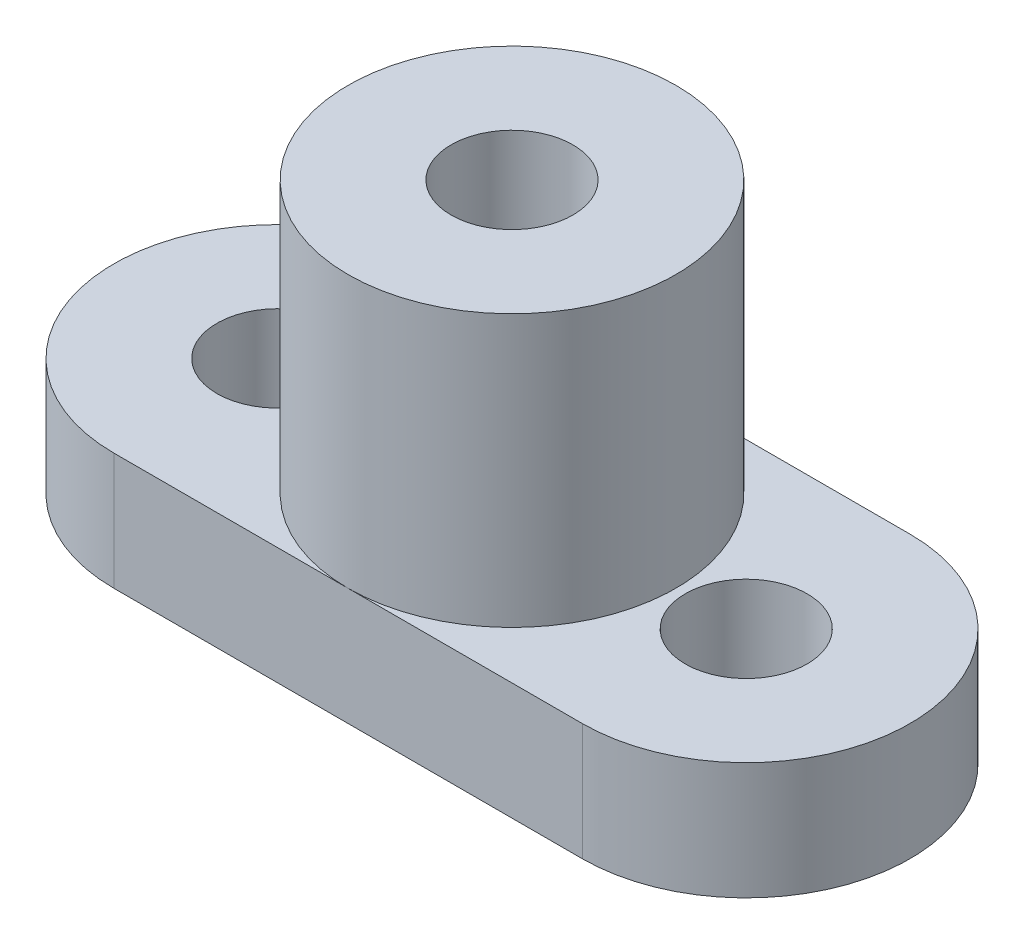
ISO-10303-21;
HEADER;
FILE_DESCRIPTION(('STEP AP214'),'2;1');
FILE_NAME('part.step','',(''),(''),'','','');
FILE_SCHEMA(('AUTOMOTIVE_DESIGN { 1 0 10303 214 1 1 1 1 }'));
ENDSEC;
DATA;
#1=APPLICATION_CONTEXT('core data for automotive mechanical design processes');
#2=APPLICATION_PROTOCOL_DEFINITION('international standard','automotive_design',2000,#1);
#3=PRODUCT_CONTEXT('',#1,'mechanical');
#4=PRODUCT('Part','Part','',(#3));
#5=PRODUCT_RELATED_PRODUCT_CATEGORY('part','',(#4));
#6=PRODUCT_DEFINITION_FORMATION('','',#4);
#7=PRODUCT_DEFINITION_CONTEXT('part definition',#1,'design');
#8=PRODUCT_DEFINITION('design','',#6,#7);
#9=PRODUCT_DEFINITION_SHAPE('','',#8);
#10=(LENGTH_UNIT() NAMED_UNIT(*) SI_UNIT(.MILLI.,.METRE.));
#11=(NAMED_UNIT(*) PLANE_ANGLE_UNIT() SI_UNIT($,.RADIAN.));
#12=(NAMED_UNIT(*) SI_UNIT($,.STERADIAN.) SOLID_ANGLE_UNIT());
#13=UNCERTAINTY_MEASURE_WITH_UNIT(LENGTH_MEASURE(1.E-05),#10,'distance_accuracy_value','');
#14=(GEOMETRIC_REPRESENTATION_CONTEXT(3) GLOBAL_UNCERTAINTY_ASSIGNED_CONTEXT((#13)) GLOBAL_UNIT_ASSIGNED_CONTEXT((#10,
#11,#12)) REPRESENTATION_CONTEXT('',''));
#15=CARTESIAN_POINT('',(0.,0.,0.));
#16=DIRECTION('',(0.,0.,1.));
#17=DIRECTION('',(1.,0.,0.));
#18=AXIS2_PLACEMENT_3D('',#15,#16,#17);
#19=CARTESIAN_POINT('',(0.,3.175,0.));
#20=DIRECTION('',(0.,1.,0.));
#21=DIRECTION('',(0.,0.,1.));
#22=AXIS2_PLACEMENT_3D('',#19,#20,#21);
#23=PLANE('',#22);
#24=CARTESIAN_POINT('',(6.35,3.175,0.));
#25=DIRECTION('',(0.,1.,0.));
#26=DIRECTION('',(0.,0.,1.));
#27=AXIS2_PLACEMENT_3D('',#24,#25,#26);
#28=CIRCLE('',#27,4.445);
#29=CARTESIAN_POINT('',(6.35,3.175,4.445));
#30=VERTEX_POINT('',#29);
#31=CARTESIAN_POINT('',(6.35,3.175,-4.445));
#32=VERTEX_POINT('',#31);
#33=EDGE_CURVE('E50',#30,#32,#28,.T.);
#34=ORIENTED_EDGE('',*,*,#33,.F.);
#35=DIRECTION('',(1.,0.,0.));
#36=VECTOR('',#35,1.);
#37=CARTESIAN_POINT('',(0.,3.175,4.445));
#38=LINE('',#37,#36);
#39=CARTESIAN_POINT('',(12.7,3.175,4.445));
#40=VERTEX_POINT('',#39);
#41=EDGE_CURVE('E99',#30,#40,#38,.T.);
#42=ORIENTED_EDGE('',*,*,#41,.T.);
#43=CARTESIAN_POINT('',(12.7,3.175,0.));
#44=DIRECTION('',(0.,1.,0.));
#45=DIRECTION('',(0.,0.,1.));
#46=AXIS2_PLACEMENT_3D('',#43,#44,#45);
#47=CIRCLE('',#46,4.445);
#48=CARTESIAN_POINT('',(12.7,3.175,-4.445));
#49=VERTEX_POINT('',#48);
#50=EDGE_CURVE('E98',#40,#49,#47,.T.);
#51=ORIENTED_EDGE('',*,*,#50,.T.);
#52=DIRECTION('',(-1.,0.,0.));
#53=VECTOR('',#52,1.);
#54=CARTESIAN_POINT('',(0.,3.175,-4.445));
#55=LINE('',#54,#53);
#56=EDGE_CURVE('E113',#49,#32,#55,.T.);
#57=ORIENTED_EDGE('',*,*,#56,.T.);
#58=EDGE_LOOP('',(#34,#42,#51,#57));
#59=FACE_BOUND('',#58,.T.);
#60=CARTESIAN_POINT('',(12.7,3.175,0.));
#61=DIRECTION('',(0.,1.,0.));
#62=DIRECTION('',(0.,0.,1.));
#63=AXIS2_PLACEMENT_3D('',#60,#61,#62);
#64=CIRCLE('',#63,1.651);
#65=CARTESIAN_POINT('',(12.7,3.175,1.651));
#66=VERTEX_POINT('',#65);
#67=EDGE_CURVE('E170',#66,#66,#64,.T.);
#68=ORIENTED_EDGE('',*,*,#67,.F.);
#69=EDGE_LOOP('',(#68));
#70=FACE_BOUND('',#69,.T.);
#71=ADVANCED_FACE('F39',(#59,#70),#23,.T.);
#72=EDGE_CURVE('E11',#32,#30,#28,.T.);
#73=ORIENTED_EDGE('',*,*,#72,.F.);
#74=CARTESIAN_POINT('',(0.,3.175,-4.445));
#75=VERTEX_POINT('',#74);
#76=EDGE_CURVE('E60',#32,#75,#55,.T.);
#77=ORIENTED_EDGE('',*,*,#76,.T.);
#78=CARTESIAN_POINT('',(0.,3.175,0.));
#79=DIRECTION('',(0.,1.,0.));
#80=DIRECTION('',(0.,0.,1.));
#81=AXIS2_PLACEMENT_3D('',#78,#79,#80);
#82=CIRCLE('',#81,4.445);
#83=CARTESIAN_POINT('',(0.,3.175,4.445));
#84=VERTEX_POINT('',#83);
#85=EDGE_CURVE('E95',#75,#84,#82,.T.);
#86=ORIENTED_EDGE('',*,*,#85,.T.);
#87=EDGE_CURVE('E89',#84,#30,#38,.T.);
#88=ORIENTED_EDGE('',*,*,#87,.T.);
#89=EDGE_LOOP('',(#73,#77,#86,#88));
#90=FACE_BOUND('',#89,.T.);
#91=CARTESIAN_POINT('',(0.,3.175,0.));
#92=DIRECTION('',(0.,1.,0.));
#93=DIRECTION('',(0.,0.,1.));
#94=AXIS2_PLACEMENT_3D('',#91,#92,#93);
#95=CIRCLE('',#94,1.651);
#96=CARTESIAN_POINT('',(0.,3.175,1.651));
#97=VERTEX_POINT('',#96);
#98=EDGE_CURVE('E162',#97,#97,#95,.T.);
#99=ORIENTED_EDGE('',*,*,#98,.F.);
#100=EDGE_LOOP('',(#99));
#101=FACE_BOUND('',#100,.T.);
#102=ADVANCED_FACE('F92',(#90,#101),#23,.T.);
#103=CARTESIAN_POINT('',(0.,0.,0.));
#104=DIRECTION('',(0.,1.,0.));
#105=DIRECTION('',(0.,0.,1.));
#106=AXIS2_PLACEMENT_3D('',#103,#104,#105);
#107=PLANE('',#106);
#108=CARTESIAN_POINT('',(0.,0.,0.));
#109=DIRECTION('',(0.,1.,0.));
#110=DIRECTION('',(0.,0.,1.));
#111=AXIS2_PLACEMENT_3D('',#108,#109,#110);
#112=CIRCLE('',#111,4.445);
#113=CARTESIAN_POINT('',(0.,0.,-4.445));
#114=VERTEX_POINT('',#113);
#115=CARTESIAN_POINT('',(0.,0.,4.445));
#116=VERTEX_POINT('',#115);
#117=EDGE_CURVE('E174',#114,#116,#112,.T.);
#118=ORIENTED_EDGE('',*,*,#117,.F.);
#119=DIRECTION('',(-1.,0.,0.));
#120=VECTOR('',#119,1.);
#121=CARTESIAN_POINT('',(0.,0.,-4.445));
#122=LINE('',#121,#120);
#123=CARTESIAN_POINT('',(12.7,0.,-4.445));
#124=VERTEX_POINT('',#123);
#125=EDGE_CURVE('E82',#124,#114,#122,.T.);
#126=ORIENTED_EDGE('',*,*,#125,.F.);
#127=CARTESIAN_POINT('',(12.7,0.,0.));
#128=DIRECTION('',(0.,1.,0.));
#129=DIRECTION('',(0.,0.,1.));
#130=AXIS2_PLACEMENT_3D('',#127,#128,#129);
#131=CIRCLE('',#130,4.445);
#132=CARTESIAN_POINT('',(12.7,0.,4.445));
#133=VERTEX_POINT('',#132);
#134=EDGE_CURVE('E191',#133,#124,#131,.T.);
#135=ORIENTED_EDGE('',*,*,#134,.F.);
#136=DIRECTION('',(1.,0.,0.));
#137=VECTOR('',#136,1.);
#138=CARTESIAN_POINT('',(0.,0.,4.445));
#139=LINE('',#138,#137);
#140=EDGE_CURVE('E188',#116,#133,#139,.T.);
#141=ORIENTED_EDGE('',*,*,#140,.F.);
#142=EDGE_LOOP('',(#118,#126,#135,#141));
#143=FACE_BOUND('',#142,.T.);
#144=CARTESIAN_POINT('',(12.7,0.,0.));
#145=DIRECTION('',(0.,1.,0.));
#146=DIRECTION('',(0.,0.,1.));
#147=AXIS2_PLACEMENT_3D('',#144,#145,#146);
#148=CIRCLE('',#147,1.651);
#149=CARTESIAN_POINT('',(12.7,0.,1.651));
#150=VERTEX_POINT('',#149);
#151=EDGE_CURVE('E166',#150,#150,#148,.T.);
#152=ORIENTED_EDGE('',*,*,#151,.T.);
#153=EDGE_LOOP('',(#152));
#154=FACE_BOUND('',#153,.T.);
#155=CARTESIAN_POINT('',(0.,0.,0.));
#156=DIRECTION('',(0.,1.,0.));
#157=DIRECTION('',(0.,0.,1.));
#158=AXIS2_PLACEMENT_3D('',#155,#156,#157);
#159=CIRCLE('',#158,1.651);
#160=CARTESIAN_POINT('',(0.,0.,1.651));
#161=VERTEX_POINT('',#160);
#162=EDGE_CURVE('E160',#161,#161,#159,.T.);
#163=ORIENTED_EDGE('',*,*,#162,.T.);
#164=EDGE_LOOP('',(#163));
#165=FACE_BOUND('',#164,.T.);
#166=ADVANCED_FACE('F141',(#143,#154,#165),#107,.F.);
#167=CARTESIAN_POINT('',(0.,3.175,0.));
#168=DIRECTION('',(0.,-1.,0.));
#169=DIRECTION('',(0.,0.,-1.));
#170=AXIS2_PLACEMENT_3D('',#167,#168,#169);
#171=CYLINDRICAL_SURFACE('',#170,4.445);
#172=ORIENTED_EDGE('',*,*,#117,.T.);
#173=DIRECTION('',(0.,-1.,0.));
#174=VECTOR('',#173,1.);
#175=CARTESIAN_POINT('',(0.,3.175,4.445));
#176=LINE('',#175,#174);
#177=EDGE_CURVE('E43',#84,#116,#176,.T.);
#178=ORIENTED_EDGE('',*,*,#177,.F.);
#179=ORIENTED_EDGE('',*,*,#85,.F.);
#180=DIRECTION('',(0.,-1.,0.));
#181=VECTOR('',#180,1.);
#182=CARTESIAN_POINT('',(0.,3.175,-4.445));
#183=LINE('',#182,#181);
#184=EDGE_CURVE('E184',#75,#114,#183,.T.);
#185=ORIENTED_EDGE('',*,*,#184,.T.);
#186=EDGE_LOOP('',(#172,#178,#179,#185));
#187=FACE_BOUND('',#186,.T.);
#188=ADVANCED_FACE('F41',(#187),#171,.T.);
#189=CARTESIAN_POINT('',(0.,3.175,4.445));
#190=DIRECTION('',(0.,0.,-1.));
#191=DIRECTION('',(-1.,0.,0.));
#192=AXIS2_PLACEMENT_3D('',#189,#190,#191);
#193=PLANE('',#192);
#194=ORIENTED_EDGE('',*,*,#140,.T.);
#195=DIRECTION('',(0.,-1.,0.));
#196=VECTOR('',#195,1.);
#197=CARTESIAN_POINT('',(12.7,3.175,4.445));
#198=LINE('',#197,#196);
#199=EDGE_CURVE('E105',#40,#133,#198,.T.);
#200=ORIENTED_EDGE('',*,*,#199,.F.);
#201=ORIENTED_EDGE('',*,*,#41,.F.);
#202=ORIENTED_EDGE('',*,*,#87,.F.);
#203=ORIENTED_EDGE('',*,*,#177,.T.);
#204=EDGE_LOOP('',(#194,#200,#201,#202,#203));
#205=FACE_BOUND('',#204,.T.);
#206=ADVANCED_FACE('F103',(#205),#193,.F.);
#207=CARTESIAN_POINT('',(12.7,3.175,0.));
#208=DIRECTION('',(0.,-1.,0.));
#209=DIRECTION('',(0.,0.,-1.));
#210=AXIS2_PLACEMENT_3D('',#207,#208,#209);
#211=CYLINDRICAL_SURFACE('',#210,4.445);
#212=ORIENTED_EDGE('',*,*,#134,.T.);
#213=DIRECTION('',(0.,-1.,0.));
#214=VECTOR('',#213,1.);
#215=CARTESIAN_POINT('',(12.7,3.175,-4.445));
#216=LINE('',#215,#214);
#217=EDGE_CURVE('E198',#49,#124,#216,.T.);
#218=ORIENTED_EDGE('',*,*,#217,.F.);
#219=ORIENTED_EDGE('',*,*,#50,.F.);
#220=ORIENTED_EDGE('',*,*,#199,.T.);
#221=EDGE_LOOP('',(#212,#218,#219,#220));
#222=FACE_BOUND('',#221,.T.);
#223=ADVANCED_FACE('F209',(#222),#211,.T.);
#224=CARTESIAN_POINT('',(0.,3.175,-4.445));
#225=DIRECTION('',(0.,0.,1.));
#226=DIRECTION('',(1.,0.,0.));
#227=AXIS2_PLACEMENT_3D('',#224,#225,#226);
#228=PLANE('',#227);
#229=ORIENTED_EDGE('',*,*,#125,.T.);
#230=ORIENTED_EDGE('',*,*,#184,.F.);
#231=ORIENTED_EDGE('',*,*,#76,.F.);
#232=ORIENTED_EDGE('',*,*,#56,.F.);
#233=ORIENTED_EDGE('',*,*,#217,.T.);
#234=EDGE_LOOP('',(#229,#230,#231,#232,#233));
#235=FACE_BOUND('',#234,.T.);
#236=ADVANCED_FACE('F210',(#235),#228,.F.);
#237=CARTESIAN_POINT('',(12.7,3.175,0.));
#238=DIRECTION('',(0.,-1.,0.));
#239=DIRECTION('',(0.,0.,-1.));
#240=AXIS2_PLACEMENT_3D('',#237,#238,#239);
#241=CYLINDRICAL_SURFACE('',#240,1.651);
#242=ORIENTED_EDGE('',*,*,#67,.T.);
#243=EDGE_LOOP('',(#242));
#244=FACE_BOUND('',#243,.T.);
#245=ORIENTED_EDGE('',*,*,#151,.F.);
#246=EDGE_LOOP('',(#245));
#247=FACE_BOUND('',#246,.T.);
#248=ADVANCED_FACE('F213',(#244,#247),#241,.F.);
#249=CARTESIAN_POINT('',(0.,3.175,0.));
#250=DIRECTION('',(0.,-1.,0.));
#251=DIRECTION('',(0.,0.,-1.));
#252=AXIS2_PLACEMENT_3D('',#249,#250,#251);
#253=CYLINDRICAL_SURFACE('',#252,1.651);
#254=ORIENTED_EDGE('',*,*,#98,.T.);
#255=EDGE_LOOP('',(#254));
#256=FACE_BOUND('',#255,.T.);
#257=ORIENTED_EDGE('',*,*,#162,.F.);
#258=EDGE_LOOP('',(#257));
#259=FACE_BOUND('',#258,.T.);
#260=ADVANCED_FACE('F131',(#256,#259),#253,.F.);
#261=CARTESIAN_POINT('',(6.35,10.541,0.));
#262=DIRECTION('',(0.,1.,0.));
#263=DIRECTION('',(0.,0.,1.));
#264=AXIS2_PLACEMENT_3D('',#261,#262,#263);
#265=PLANE('',#264);
#266=CARTESIAN_POINT('',(6.35,10.541,0.));
#267=DIRECTION('',(0.,1.,0.));
#268=DIRECTION('',(0.,0.,1.));
#269=AXIS2_PLACEMENT_3D('',#266,#267,#268);
#270=CIRCLE('',#269,4.445);
#271=CARTESIAN_POINT('',(6.35,10.541,4.445));
#272=VERTEX_POINT('',#271);
#273=EDGE_CURVE('E116',#272,#272,#270,.T.);
#274=ORIENTED_EDGE('',*,*,#273,.T.);
#275=EDGE_LOOP('',(#274));
#276=FACE_BOUND('',#275,.T.);
#277=CARTESIAN_POINT('',(6.35,10.541,0.));
#278=DIRECTION('',(0.,1.,0.));
#279=DIRECTION('',(0.,0.,1.));
#280=AXIS2_PLACEMENT_3D('',#277,#278,#279);
#281=CIRCLE('',#280,1.651);
#282=CARTESIAN_POINT('',(6.35,10.541,1.651));
#283=VERTEX_POINT('',#282);
#284=EDGE_CURVE('E117',#283,#283,#281,.T.);
#285=ORIENTED_EDGE('',*,*,#284,.F.);
#286=EDGE_LOOP('',(#285));
#287=FACE_BOUND('',#286,.T.);
#288=ADVANCED_FACE('F121',(#276,#287),#265,.T.);
#289=CARTESIAN_POINT('',(6.35,10.541,0.));
#290=DIRECTION('',(0.,-1.,0.));
#291=DIRECTION('',(0.,0.,-1.));
#292=AXIS2_PLACEMENT_3D('',#289,#290,#291);
#293=CYLINDRICAL_SURFACE('',#292,4.445);
#294=ORIENTED_EDGE('',*,*,#273,.F.);
#295=EDGE_LOOP('',(#294));
#296=FACE_BOUND('',#295,.T.);
#297=ORIENTED_EDGE('',*,*,#33,.T.);
#298=ORIENTED_EDGE('',*,*,#72,.T.);
#299=EDGE_LOOP('',(#297,#298));
#300=FACE_BOUND('',#299,.T.);
#301=ADVANCED_FACE('F118',(#296,#300),#293,.T.);
#302=CARTESIAN_POINT('',(6.35,10.541,0.));
#303=DIRECTION('',(0.,-1.,0.));
#304=DIRECTION('',(0.,0.,-1.));
#305=AXIS2_PLACEMENT_3D('',#302,#303,#304);
#306=CYLINDRICAL_SURFACE('',#305,1.651);
#307=ORIENTED_EDGE('',*,*,#284,.T.);
#308=EDGE_LOOP('',(#307));
#309=FACE_BOUND('',#308,.T.);
#310=CARTESIAN_POINT('',(6.35,3.175,0.));
#311=DIRECTION('',(0.,1.,0.));
#312=DIRECTION('',(0.,0.,1.));
#313=AXIS2_PLACEMENT_3D('',#310,#311,#312);
#314=CIRCLE('',#313,1.651);
#315=CARTESIAN_POINT('',(6.35,3.175,1.651));
#316=VERTEX_POINT('',#315);
#317=EDGE_CURVE('E150',#316,#316,#314,.T.);
#318=ORIENTED_EDGE('',*,*,#317,.F.);
#319=EDGE_LOOP('',(#318));
#320=FACE_BOUND('',#319,.T.);
#321=ADVANCED_FACE('F120',(#309,#320),#306,.F.);
#322=ORIENTED_EDGE('',*,*,#317,.T.);
#323=EDGE_LOOP('',(#322));
#324=FACE_BOUND('',#323,.T.);
#325=ADVANCED_FACE('F128',(#324),#23,.T.);
#326=CLOSED_SHELL('',(#71,#102,#166,#188,#206,#223,#236,#248,#260,#288,#301,#321,#325));
#327=MANIFOLD_SOLID_BREP('B2',#326);
#328=ADVANCED_BREP_SHAPE_REPRESENTATION('',(#18,#327),#14);
#329=SHAPE_DEFINITION_REPRESENTATION(#9,#328);
ENDSEC;
END-ISO-10303-21;
